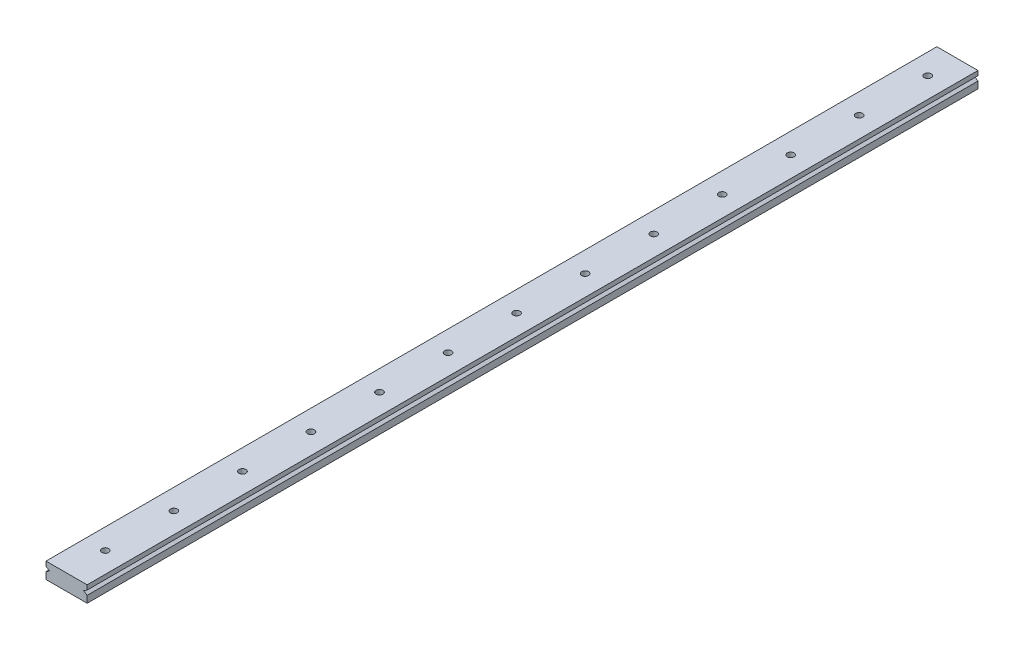
ISO-10303-21;
HEADER;
FILE_DESCRIPTION(('STEP AP214'),'2;1');
FILE_NAME('part.step','',(''),(''),'','','');
FILE_SCHEMA(('AUTOMOTIVE_DESIGN { 1 0 10303 214 1 1 1 1 }'));
ENDSEC;
DATA;
#1=APPLICATION_CONTEXT('core data for automotive mechanical design processes');
#2=APPLICATION_PROTOCOL_DEFINITION('international standard','automotive_design',2000,#1);
#3=PRODUCT_CONTEXT('',#1,'mechanical');
#4=PRODUCT('Part','Part','',(#3));
#5=PRODUCT_RELATED_PRODUCT_CATEGORY('part','',(#4));
#6=PRODUCT_DEFINITION_FORMATION('','',#4);
#7=PRODUCT_DEFINITION_CONTEXT('part definition',#1,'design');
#8=PRODUCT_DEFINITION('design','',#6,#7);
#9=PRODUCT_DEFINITION_SHAPE('','',#8);
#10=(LENGTH_UNIT() NAMED_UNIT(*) SI_UNIT(.MILLI.,.METRE.));
#11=(NAMED_UNIT(*) PLANE_ANGLE_UNIT() SI_UNIT($,.RADIAN.));
#12=(NAMED_UNIT(*) SI_UNIT($,.STERADIAN.) SOLID_ANGLE_UNIT());
#13=UNCERTAINTY_MEASURE_WITH_UNIT(LENGTH_MEASURE(1.E-05),#10,'distance_accuracy_value','');
#14=(GEOMETRIC_REPRESENTATION_CONTEXT(3) GLOBAL_UNCERTAINTY_ASSIGNED_CONTEXT((#13)) GLOBAL_UNIT_ASSIGNED_CONTEXT((#10,
#11,#12)) REPRESENTATION_CONTEXT('',''));
#15=CARTESIAN_POINT('',(0.,0.,0.));
#16=DIRECTION('',(0.,0.,1.));
#17=DIRECTION('',(1.,0.,0.));
#18=AXIS2_PLACEMENT_3D('',#15,#16,#17);
#19=CARTESIAN_POINT('',(9.,-3.5,390.));
#20=DIRECTION('',(-1.,0.,0.));
#21=DIRECTION('',(0.,0.,1.));
#22=AXIS2_PLACEMENT_3D('',#19,#20,#21);
#23=PLANE('',#22);
#24=DIRECTION('',(0.,0.,-1.));
#25=VECTOR('',#24,1.);
#26=CARTESIAN_POINT('',(9.,1.5,390.));
#27=LINE('',#26,#25);
#28=CARTESIAN_POINT('',(9.,1.5,390.));
#29=VERTEX_POINT('',#28);
#30=CARTESIAN_POINT('',(9.,1.5,0.));
#31=VERTEX_POINT('',#30);
#32=EDGE_CURVE('E111',#29,#31,#27,.T.);
#33=ORIENTED_EDGE('',*,*,#32,.T.);
#34=DIRECTION('',(0.,1.,0.));
#35=VECTOR('',#34,1.);
#36=CARTESIAN_POINT('',(9.,-3.5,0.));
#37=LINE('',#36,#35);
#38=CARTESIAN_POINT('',(9.,3.5,0.));
#39=VERTEX_POINT('',#38);
#40=EDGE_CURVE('E155',#31,#39,#37,.T.);
#41=ORIENTED_EDGE('',*,*,#40,.T.);
#42=DIRECTION('',(0.,0.,-1.));
#43=VECTOR('',#42,1.);
#44=CARTESIAN_POINT('',(9.,3.5,390.));
#45=LINE('',#44,#43);
#46=CARTESIAN_POINT('',(9.,3.5,390.));
#47=VERTEX_POINT('',#46);
#48=EDGE_CURVE('E11',#47,#39,#45,.T.);
#49=ORIENTED_EDGE('',*,*,#48,.F.);
#50=DIRECTION('',(0.,1.,0.));
#51=VECTOR('',#50,1.);
#52=CARTESIAN_POINT('',(9.,-3.5,390.));
#53=LINE('',#52,#51);
#54=EDGE_CURVE('E127',#29,#47,#53,.T.);
#55=ORIENTED_EDGE('',*,*,#54,.F.);
#56=EDGE_LOOP('',(#33,#41,#49,#55));
#57=FACE_BOUND('',#56,.T.);
#58=ADVANCED_FACE('F34',(#57),#23,.F.);
#59=DIRECTION('',(0.,0.,-1.));
#60=VECTOR('',#59,1.);
#61=CARTESIAN_POINT('',(9.,-0.499999999999999,390.));
#62=LINE('',#61,#60);
#63=CARTESIAN_POINT('',(9.,-0.499999999999999,390.));
#64=VERTEX_POINT('',#63);
#65=CARTESIAN_POINT('',(9.,-0.499999999999999,0.));
#66=VERTEX_POINT('',#65);
#67=EDGE_CURVE('E58',#64,#66,#62,.T.);
#68=ORIENTED_EDGE('',*,*,#67,.F.);
#69=CARTESIAN_POINT('',(9.,-3.5,390.));
#70=VERTEX_POINT('',#69);
#71=EDGE_CURVE('E133',#70,#64,#53,.T.);
#72=ORIENTED_EDGE('',*,*,#71,.F.);
#73=DIRECTION('',(0.,0.,-1.));
#74=VECTOR('',#73,1.);
#75=CARTESIAN_POINT('',(9.,-3.5,390.));
#76=LINE('',#75,#74);
#77=CARTESIAN_POINT('',(9.,-3.5,0.));
#78=VERTEX_POINT('',#77);
#79=EDGE_CURVE('E150',#70,#78,#76,.T.);
#80=ORIENTED_EDGE('',*,*,#79,.T.);
#81=EDGE_CURVE('E151',#78,#66,#37,.T.);
#82=ORIENTED_EDGE('',*,*,#81,.T.);
#83=EDGE_LOOP('',(#68,#72,#80,#82));
#84=FACE_BOUND('',#83,.T.);
#85=ADVANCED_FACE('F295',(#84),#23,.F.);
#86=CARTESIAN_POINT('',(-9.,-3.5,390.));
#87=DIRECTION('',(1.,0.,0.));
#88=DIRECTION('',(0.,0.,-1.));
#89=AXIS2_PLACEMENT_3D('',#86,#87,#88);
#90=PLANE('',#89);
#91=DIRECTION('',(0.,-1.,0.));
#92=VECTOR('',#91,1.);
#93=CARTESIAN_POINT('',(-9.,-3.5,0.));
#94=LINE('',#93,#92);
#95=CARTESIAN_POINT('',(-9.,3.5,0.));
#96=VERTEX_POINT('',#95);
#97=CARTESIAN_POINT('',(-9.,1.5,0.));
#98=VERTEX_POINT('',#97);
#99=EDGE_CURVE('E137',#96,#98,#94,.T.);
#100=ORIENTED_EDGE('',*,*,#99,.T.);
#101=DIRECTION('',(0.,0.,-1.));
#102=VECTOR('',#101,1.);
#103=CARTESIAN_POINT('',(-9.,1.5,390.));
#104=LINE('',#103,#102);
#105=CARTESIAN_POINT('',(-9.,1.5,390.));
#106=VERTEX_POINT('',#105);
#107=EDGE_CURVE('E221',#106,#98,#104,.T.);
#108=ORIENTED_EDGE('',*,*,#107,.F.);
#109=DIRECTION('',(0.,-1.,0.));
#110=VECTOR('',#109,1.);
#111=CARTESIAN_POINT('',(-9.,-3.5,390.));
#112=LINE('',#111,#110);
#113=CARTESIAN_POINT('',(-9.,3.5,390.));
#114=VERTEX_POINT('',#113);
#115=EDGE_CURVE('E145',#114,#106,#112,.T.);
#116=ORIENTED_EDGE('',*,*,#115,.F.);
#117=DIRECTION('',(0.,0.,-1.));
#118=VECTOR('',#117,1.);
#119=CARTESIAN_POINT('',(-9.,3.5,390.));
#120=LINE('',#119,#118);
#121=EDGE_CURVE('E42',#114,#96,#120,.T.);
#122=ORIENTED_EDGE('',*,*,#121,.T.);
#123=EDGE_LOOP('',(#100,#108,#116,#122));
#124=FACE_BOUND('',#123,.T.);
#125=ADVANCED_FACE('F220',(#124),#90,.F.);
#126=CARTESIAN_POINT('',(0.,0.,390.));
#127=DIRECTION('',(0.,0.,-1.));
#128=DIRECTION('',(-1.,0.,0.));
#129=AXIS2_PLACEMENT_3D('',#126,#127,#128);
#130=PLANE('',#129);
#131=DIRECTION('',(-0.832050294337844,-0.554700196225229,0.));
#132=VECTOR('',#131,1.);
#133=CARTESIAN_POINT('',(2.07692307692308,-3.11538461538461,390.));
#134=LINE('',#133,#132);
#135=CARTESIAN_POINT('',(7.5,0.500000000000001,390.));
#136=VERTEX_POINT('',#135);
#137=EDGE_CURVE('E115',#29,#136,#134,.T.);
#138=ORIENTED_EDGE('',*,*,#137,.F.);
#139=ORIENTED_EDGE('',*,*,#54,.T.);
#140=DIRECTION('',(-1.,0.,0.));
#141=VECTOR('',#140,1.);
#142=CARTESIAN_POINT('',(-9.,3.5,390.));
#143=LINE('',#142,#141);
#144=EDGE_CURVE('E136',#47,#114,#143,.T.);
#145=ORIENTED_EDGE('',*,*,#144,.T.);
#146=ORIENTED_EDGE('',*,*,#115,.T.);
#147=DIRECTION('',(0.832050294337844,-0.554700196225229,0.));
#148=VECTOR('',#147,1.);
#149=CARTESIAN_POINT('',(-2.07692307692308,-3.11538461538461,390.));
#150=LINE('',#149,#148);
#151=CARTESIAN_POINT('',(-7.5,0.500000000000001,390.));
#152=VERTEX_POINT('',#151);
#153=EDGE_CURVE('E217',#106,#152,#150,.T.);
#154=ORIENTED_EDGE('',*,*,#153,.T.);
#155=DIRECTION('',(-0.832050294337844,-0.554700196225229,0.));
#156=VECTOR('',#155,1.);
#157=CARTESIAN_POINT('',(-2.53846153846154,3.80769230769231,390.));
#158=LINE('',#157,#156);
#159=CARTESIAN_POINT('',(-9.,-0.499999999999999,390.));
#160=VERTEX_POINT('',#159);
#161=EDGE_CURVE('E233',#152,#160,#158,.T.);
#162=ORIENTED_EDGE('',*,*,#161,.T.);
#163=CARTESIAN_POINT('',(-9.,-3.5,390.));
#164=VERTEX_POINT('',#163);
#165=EDGE_CURVE('E144',#160,#164,#112,.T.);
#166=ORIENTED_EDGE('',*,*,#165,.T.);
#167=DIRECTION('',(1.,0.,0.));
#168=VECTOR('',#167,1.);
#169=CARTESIAN_POINT('',(-9.,-3.5,390.));
#170=LINE('',#169,#168);
#171=EDGE_CURVE('E148',#164,#70,#170,.T.);
#172=ORIENTED_EDGE('',*,*,#171,.T.);
#173=ORIENTED_EDGE('',*,*,#71,.T.);
#174=DIRECTION('',(0.832050294337844,-0.554700196225229,0.));
#175=VECTOR('',#174,1.);
#176=CARTESIAN_POINT('',(2.53846153846154,3.80769230769231,390.));
#177=LINE('',#176,#175);
#178=EDGE_CURVE('E122',#136,#64,#177,.T.);
#179=ORIENTED_EDGE('',*,*,#178,.F.);
#180=EDGE_LOOP('',(#138,#139,#145,#146,#154,#162,#166,#172,#173,#179));
#181=FACE_BOUND('',#180,.T.);
#182=ADVANCED_FACE('F126',(#181),#130,.F.);
#183=CARTESIAN_POINT('',(0.,0.,0.));
#184=DIRECTION('',(0.,0.,-1.));
#185=DIRECTION('',(-1.,0.,0.));
#186=AXIS2_PLACEMENT_3D('',#183,#184,#185);
#187=PLANE('',#186);
#188=ORIENTED_EDGE('',*,*,#40,.F.);
#189=DIRECTION('',(-0.832050294337844,-0.554700196225229,0.));
#190=VECTOR('',#189,1.);
#191=CARTESIAN_POINT('',(2.07692307692308,-3.11538461538461,0.));
#192=LINE('',#191,#190);
#193=CARTESIAN_POINT('',(7.5,0.500000000000001,0.));
#194=VERTEX_POINT('',#193);
#195=EDGE_CURVE('E118',#31,#194,#192,.T.);
#196=ORIENTED_EDGE('',*,*,#195,.T.);
#197=DIRECTION('',(0.832050294337844,-0.554700196225229,0.));
#198=VECTOR('',#197,1.);
#199=CARTESIAN_POINT('',(2.53846153846154,3.80769230769231,0.));
#200=LINE('',#199,#198);
#201=EDGE_CURVE('E130',#194,#66,#200,.T.);
#202=ORIENTED_EDGE('',*,*,#201,.T.);
#203=ORIENTED_EDGE('',*,*,#81,.F.);
#204=DIRECTION('',(1.,0.,0.));
#205=VECTOR('',#204,1.);
#206=CARTESIAN_POINT('',(-9.,-3.5,0.));
#207=LINE('',#206,#205);
#208=CARTESIAN_POINT('',(-9.,-3.5,0.));
#209=VERTEX_POINT('',#208);
#210=EDGE_CURVE('E134',#209,#78,#207,.T.);
#211=ORIENTED_EDGE('',*,*,#210,.F.);
#212=CARTESIAN_POINT('',(-9.,-0.499999999999999,0.));
#213=VERTEX_POINT('',#212);
#214=EDGE_CURVE('E157',#213,#209,#94,.T.);
#215=ORIENTED_EDGE('',*,*,#214,.F.);
#216=DIRECTION('',(-0.832050294337844,-0.554700196225229,0.));
#217=VECTOR('',#216,1.);
#218=CARTESIAN_POINT('',(-2.53846153846154,3.80769230769231,0.));
#219=LINE('',#218,#217);
#220=CARTESIAN_POINT('',(-7.5,0.500000000000002,0.));
#221=VERTEX_POINT('',#220);
#222=EDGE_CURVE('E229',#221,#213,#219,.T.);
#223=ORIENTED_EDGE('',*,*,#222,.F.);
#224=DIRECTION('',(0.832050294337844,-0.554700196225229,0.));
#225=VECTOR('',#224,1.);
#226=CARTESIAN_POINT('',(-2.07692307692308,-3.11538461538461,0.));
#227=LINE('',#226,#225);
#228=EDGE_CURVE('E50',#98,#221,#227,.T.);
#229=ORIENTED_EDGE('',*,*,#228,.F.);
#230=ORIENTED_EDGE('',*,*,#99,.F.);
#231=DIRECTION('',(-1.,0.,0.));
#232=VECTOR('',#231,1.);
#233=CARTESIAN_POINT('',(-9.,3.5,0.));
#234=LINE('',#233,#232);
#235=EDGE_CURVE('E154',#39,#96,#234,.T.);
#236=ORIENTED_EDGE('',*,*,#235,.F.);
#237=EDGE_LOOP('',(#188,#196,#202,#203,#211,#215,#223,#229,#230,#236));
#238=FACE_BOUND('',#237,.T.);
#239=ADVANCED_FACE('F210',(#238),#187,.T.);
#240=CARTESIAN_POINT('',(-9.,3.5,390.));
#241=DIRECTION('',(0.,-1.,0.));
#242=DIRECTION('',(0.,0.,-1.));
#243=AXIS2_PLACEMENT_3D('',#240,#241,#242);
#244=PLANE('',#243);
#245=CARTESIAN_POINT('',(0.,3.5,13.));
#246=DIRECTION('',(0.,1.,0.));
#247=DIRECTION('',(0.,0.,1.));
#248=AXIS2_PLACEMENT_3D('',#245,#246,#247);
#249=CIRCLE('',#248,1.5);
#250=CARTESIAN_POINT('',(0.,3.5,14.5));
#251=VERTEX_POINT('',#250);
#252=EDGE_CURVE('E171',#251,#251,#249,.T.);
#253=ORIENTED_EDGE('',*,*,#252,.F.);
#254=EDGE_LOOP('',(#253));
#255=FACE_BOUND('',#254,.T.);
#256=CARTESIAN_POINT('',(0.,3.5,43.));
#257=DIRECTION('',(0.,1.,0.));
#258=DIRECTION('',(0.,0.,1.));
#259=AXIS2_PLACEMENT_3D('',#256,#257,#258);
#260=CIRCLE('',#259,1.5);
#261=CARTESIAN_POINT('',(0.,3.5,44.5));
#262=VERTEX_POINT('',#261);
#263=EDGE_CURVE('E236',#262,#262,#260,.T.);
#264=ORIENTED_EDGE('',*,*,#263,.F.);
#265=EDGE_LOOP('',(#264));
#266=FACE_BOUND('',#265,.T.);
#267=CARTESIAN_POINT('',(0.,3.5,73.));
#268=DIRECTION('',(0.,1.,0.));
#269=DIRECTION('',(0.,0.,1.));
#270=AXIS2_PLACEMENT_3D('',#267,#268,#269);
#271=CIRCLE('',#270,1.5);
#272=CARTESIAN_POINT('',(0.,3.5,74.5));
#273=VERTEX_POINT('',#272);
#274=EDGE_CURVE('E239',#273,#273,#271,.T.);
#275=ORIENTED_EDGE('',*,*,#274,.F.);
#276=EDGE_LOOP('',(#275));
#277=FACE_BOUND('',#276,.T.);
#278=CARTESIAN_POINT('',(0.,3.5,133.));
#279=DIRECTION('',(0.,1.,0.));
#280=DIRECTION('',(0.,0.,1.));
#281=AXIS2_PLACEMENT_3D('',#278,#279,#280);
#282=CIRCLE('',#281,1.5);
#283=CARTESIAN_POINT('',(0.,3.5,134.5));
#284=VERTEX_POINT('',#283);
#285=EDGE_CURVE('E242',#284,#284,#282,.T.);
#286=ORIENTED_EDGE('',*,*,#285,.F.);
#287=EDGE_LOOP('',(#286));
#288=FACE_BOUND('',#287,.T.);
#289=CARTESIAN_POINT('',(0.,3.5,103.));
#290=DIRECTION('',(0.,1.,0.));
#291=DIRECTION('',(0.,0.,1.));
#292=AXIS2_PLACEMENT_3D('',#289,#290,#291);
#293=CIRCLE('',#292,1.5);
#294=CARTESIAN_POINT('',(0.,3.5,104.5));
#295=VERTEX_POINT('',#294);
#296=EDGE_CURVE('E245',#295,#295,#293,.T.);
#297=ORIENTED_EDGE('',*,*,#296,.F.);
#298=EDGE_LOOP('',(#297));
#299=FACE_BOUND('',#298,.T.);
#300=CARTESIAN_POINT('',(0.,3.5,163.));
#301=DIRECTION('',(0.,1.,0.));
#302=DIRECTION('',(0.,0.,1.));
#303=AXIS2_PLACEMENT_3D('',#300,#301,#302);
#304=CIRCLE('',#303,1.5);
#305=CARTESIAN_POINT('',(0.,3.5,164.5));
#306=VERTEX_POINT('',#305);
#307=EDGE_CURVE('E248',#306,#306,#304,.T.);
#308=ORIENTED_EDGE('',*,*,#307,.F.);
#309=EDGE_LOOP('',(#308));
#310=FACE_BOUND('',#309,.T.);
#311=CARTESIAN_POINT('',(0.,3.5,193.));
#312=DIRECTION('',(0.,1.,0.));
#313=DIRECTION('',(0.,0.,1.));
#314=AXIS2_PLACEMENT_3D('',#311,#312,#313);
#315=CIRCLE('',#314,1.5);
#316=CARTESIAN_POINT('',(0.,3.5,194.5));
#317=VERTEX_POINT('',#316);
#318=EDGE_CURVE('E251',#317,#317,#315,.T.);
#319=ORIENTED_EDGE('',*,*,#318,.F.);
#320=EDGE_LOOP('',(#319));
#321=FACE_BOUND('',#320,.T.);
#322=CARTESIAN_POINT('',(0.,3.5,223.));
#323=DIRECTION('',(0.,1.,0.));
#324=DIRECTION('',(0.,0.,1.));
#325=AXIS2_PLACEMENT_3D('',#322,#323,#324);
#326=CIRCLE('',#325,1.5);
#327=CARTESIAN_POINT('',(0.,3.5,224.5));
#328=VERTEX_POINT('',#327);
#329=EDGE_CURVE('E254',#328,#328,#326,.T.);
#330=ORIENTED_EDGE('',*,*,#329,.F.);
#331=EDGE_LOOP('',(#330));
#332=FACE_BOUND('',#331,.T.);
#333=CARTESIAN_POINT('',(0.,3.5,253.));
#334=DIRECTION('',(0.,1.,0.));
#335=DIRECTION('',(0.,0.,1.));
#336=AXIS2_PLACEMENT_3D('',#333,#334,#335);
#337=CIRCLE('',#336,1.5);
#338=CARTESIAN_POINT('',(0.,3.5,254.5));
#339=VERTEX_POINT('',#338);
#340=EDGE_CURVE('E257',#339,#339,#337,.T.);
#341=ORIENTED_EDGE('',*,*,#340,.F.);
#342=EDGE_LOOP('',(#341));
#343=FACE_BOUND('',#342,.T.);
#344=CARTESIAN_POINT('',(0.,3.5,283.));
#345=DIRECTION('',(0.,1.,0.));
#346=DIRECTION('',(0.,0.,1.));
#347=AXIS2_PLACEMENT_3D('',#344,#345,#346);
#348=CIRCLE('',#347,1.5);
#349=CARTESIAN_POINT('',(0.,3.5,284.5));
#350=VERTEX_POINT('',#349);
#351=EDGE_CURVE('E260',#350,#350,#348,.T.);
#352=ORIENTED_EDGE('',*,*,#351,.F.);
#353=EDGE_LOOP('',(#352));
#354=FACE_BOUND('',#353,.T.);
#355=CARTESIAN_POINT('',(0.,3.5,313.));
#356=DIRECTION('',(0.,1.,0.));
#357=DIRECTION('',(0.,0.,1.));
#358=AXIS2_PLACEMENT_3D('',#355,#356,#357);
#359=CIRCLE('',#358,1.5);
#360=CARTESIAN_POINT('',(0.,3.5,314.5));
#361=VERTEX_POINT('',#360);
#362=EDGE_CURVE('E263',#361,#361,#359,.T.);
#363=ORIENTED_EDGE('',*,*,#362,.F.);
#364=EDGE_LOOP('',(#363));
#365=FACE_BOUND('',#364,.T.);
#366=CARTESIAN_POINT('',(0.,3.5,343.));
#367=DIRECTION('',(0.,1.,0.));
#368=DIRECTION('',(0.,0.,1.));
#369=AXIS2_PLACEMENT_3D('',#366,#367,#368);
#370=CIRCLE('',#369,1.5);
#371=CARTESIAN_POINT('',(0.,3.5,344.5));
#372=VERTEX_POINT('',#371);
#373=EDGE_CURVE('E265',#372,#372,#370,.T.);
#374=ORIENTED_EDGE('',*,*,#373,.F.);
#375=EDGE_LOOP('',(#374));
#376=FACE_BOUND('',#375,.T.);
#377=CARTESIAN_POINT('',(0.,3.5,373.));
#378=DIRECTION('',(0.,1.,0.));
#379=DIRECTION('',(0.,0.,1.));
#380=AXIS2_PLACEMENT_3D('',#377,#378,#379);
#381=CIRCLE('',#380,1.5);
#382=CARTESIAN_POINT('',(0.,3.5,374.5));
#383=VERTEX_POINT('',#382);
#384=EDGE_CURVE('E141',#383,#383,#381,.T.);
#385=ORIENTED_EDGE('',*,*,#384,.F.);
#386=EDGE_LOOP('',(#385));
#387=FACE_BOUND('',#386,.T.);
#388=ORIENTED_EDGE('',*,*,#235,.T.);
#389=ORIENTED_EDGE('',*,*,#121,.F.);
#390=ORIENTED_EDGE('',*,*,#144,.F.);
#391=ORIENTED_EDGE('',*,*,#48,.T.);
#392=EDGE_LOOP('',(#388,#389,#390,#391));
#393=FACE_BOUND('',#392,.T.);
#394=ADVANCED_FACE('F213',(#255,#266,#277,#288,#299,#310,#321,#332,#343,#354,#365,#376,#387,
#393),#244,.F.);
#395=ORIENTED_EDGE('',*,*,#165,.F.);
#396=DIRECTION('',(0.,0.,-1.));
#397=VECTOR('',#396,1.);
#398=CARTESIAN_POINT('',(-9.,-0.499999999999999,390.));
#399=LINE('',#398,#397);
#400=EDGE_CURVE('E222',#160,#213,#399,.T.);
#401=ORIENTED_EDGE('',*,*,#400,.T.);
#402=ORIENTED_EDGE('',*,*,#214,.T.);
#403=DIRECTION('',(0.,0.,-1.));
#404=VECTOR('',#403,1.);
#405=CARTESIAN_POINT('',(-9.,-3.5,390.));
#406=LINE('',#405,#404);
#407=EDGE_CURVE('E162',#164,#209,#406,.T.);
#408=ORIENTED_EDGE('',*,*,#407,.F.);
#409=EDGE_LOOP('',(#395,#401,#402,#408));
#410=FACE_BOUND('',#409,.T.);
#411=ADVANCED_FACE('F285',(#410),#90,.F.);
#412=CARTESIAN_POINT('',(-9.,-3.5,390.));
#413=DIRECTION('',(0.,1.,0.));
#414=DIRECTION('',(0.,0.,1.));
#415=AXIS2_PLACEMENT_3D('',#412,#413,#414);
#416=PLANE('',#415);
#417=CARTESIAN_POINT('',(0.,-3.5,13.));
#418=DIRECTION('',(0.,1.,0.));
#419=DIRECTION('',(0.,0.,1.));
#420=AXIS2_PLACEMENT_3D('',#417,#418,#419);
#421=CIRCLE('',#420,1.5);
#422=CARTESIAN_POINT('',(0.,-3.5,14.5));
#423=VERTEX_POINT('',#422);
#424=EDGE_CURVE('E37',#423,#423,#421,.T.);
#425=ORIENTED_EDGE('',*,*,#424,.T.);
#426=EDGE_LOOP('',(#425));
#427=FACE_BOUND('',#426,.T.);
#428=CARTESIAN_POINT('',(0.,-3.5,43.));
#429=DIRECTION('',(0.,1.,0.));
#430=DIRECTION('',(0.,0.,1.));
#431=AXIS2_PLACEMENT_3D('',#428,#429,#430);
#432=CIRCLE('',#431,1.5);
#433=CARTESIAN_POINT('',(0.,-3.5,44.5));
#434=VERTEX_POINT('',#433);
#435=EDGE_CURVE('E200',#434,#434,#432,.T.);
#436=ORIENTED_EDGE('',*,*,#435,.T.);
#437=EDGE_LOOP('',(#436));
#438=FACE_BOUND('',#437,.T.);
#439=CARTESIAN_POINT('',(0.,-3.5,73.));
#440=DIRECTION('',(0.,1.,0.));
#441=DIRECTION('',(0.,0.,1.));
#442=AXIS2_PLACEMENT_3D('',#439,#440,#441);
#443=CIRCLE('',#442,1.5);
#444=CARTESIAN_POINT('',(0.,-3.5,74.5));
#445=VERTEX_POINT('',#444);
#446=EDGE_CURVE('E198',#445,#445,#443,.T.);
#447=ORIENTED_EDGE('',*,*,#446,.T.);
#448=EDGE_LOOP('',(#447));
#449=FACE_BOUND('',#448,.T.);
#450=CARTESIAN_POINT('',(0.,-3.5,133.));
#451=DIRECTION('',(0.,1.,0.));
#452=DIRECTION('',(0.,0.,1.));
#453=AXIS2_PLACEMENT_3D('',#450,#451,#452);
#454=CIRCLE('',#453,1.5);
#455=CARTESIAN_POINT('',(0.,-3.5,134.5));
#456=VERTEX_POINT('',#455);
#457=EDGE_CURVE('E195',#456,#456,#454,.T.);
#458=ORIENTED_EDGE('',*,*,#457,.T.);
#459=EDGE_LOOP('',(#458));
#460=FACE_BOUND('',#459,.T.);
#461=CARTESIAN_POINT('',(0.,-3.5,103.));
#462=DIRECTION('',(0.,1.,0.));
#463=DIRECTION('',(0.,0.,1.));
#464=AXIS2_PLACEMENT_3D('',#461,#462,#463);
#465=CIRCLE('',#464,1.5);
#466=CARTESIAN_POINT('',(0.,-3.5,104.5));
#467=VERTEX_POINT('',#466);
#468=EDGE_CURVE('E192',#467,#467,#465,.T.);
#469=ORIENTED_EDGE('',*,*,#468,.T.);
#470=EDGE_LOOP('',(#469));
#471=FACE_BOUND('',#470,.T.);
#472=CARTESIAN_POINT('',(0.,-3.5,163.));
#473=DIRECTION('',(0.,1.,0.));
#474=DIRECTION('',(0.,0.,1.));
#475=AXIS2_PLACEMENT_3D('',#472,#473,#474);
#476=CIRCLE('',#475,1.5);
#477=CARTESIAN_POINT('',(0.,-3.5,164.5));
#478=VERTEX_POINT('',#477);
#479=EDGE_CURVE('E189',#478,#478,#476,.T.);
#480=ORIENTED_EDGE('',*,*,#479,.T.);
#481=EDGE_LOOP('',(#480));
#482=FACE_BOUND('',#481,.T.);
#483=CARTESIAN_POINT('',(0.,-3.5,193.));
#484=DIRECTION('',(0.,1.,0.));
#485=DIRECTION('',(0.,0.,1.));
#486=AXIS2_PLACEMENT_3D('',#483,#484,#485);
#487=CIRCLE('',#486,1.5);
#488=CARTESIAN_POINT('',(0.,-3.5,194.5));
#489=VERTEX_POINT('',#488);
#490=EDGE_CURVE('E186',#489,#489,#487,.T.);
#491=ORIENTED_EDGE('',*,*,#490,.T.);
#492=EDGE_LOOP('',(#491));
#493=FACE_BOUND('',#492,.T.);
#494=CARTESIAN_POINT('',(0.,-3.5,223.));
#495=DIRECTION('',(0.,1.,0.));
#496=DIRECTION('',(0.,0.,1.));
#497=AXIS2_PLACEMENT_3D('',#494,#495,#496);
#498=CIRCLE('',#497,1.5);
#499=CARTESIAN_POINT('',(0.,-3.5,224.5));
#500=VERTEX_POINT('',#499);
#501=EDGE_CURVE('E183',#500,#500,#498,.T.);
#502=ORIENTED_EDGE('',*,*,#501,.T.);
#503=EDGE_LOOP('',(#502));
#504=FACE_BOUND('',#503,.T.);
#505=CARTESIAN_POINT('',(0.,-3.5,253.));
#506=DIRECTION('',(0.,1.,0.));
#507=DIRECTION('',(0.,0.,1.));
#508=AXIS2_PLACEMENT_3D('',#505,#506,#507);
#509=CIRCLE('',#508,1.5);
#510=CARTESIAN_POINT('',(0.,-3.5,254.5));
#511=VERTEX_POINT('',#510);
#512=EDGE_CURVE('E180',#511,#511,#509,.T.);
#513=ORIENTED_EDGE('',*,*,#512,.T.);
#514=EDGE_LOOP('',(#513));
#515=FACE_BOUND('',#514,.T.);
#516=CARTESIAN_POINT('',(0.,-3.5,283.));
#517=DIRECTION('',(0.,1.,0.));
#518=DIRECTION('',(0.,0.,1.));
#519=AXIS2_PLACEMENT_3D('',#516,#517,#518);
#520=CIRCLE('',#519,1.5);
#521=CARTESIAN_POINT('',(0.,-3.5,284.5));
#522=VERTEX_POINT('',#521);
#523=EDGE_CURVE('E177',#522,#522,#520,.T.);
#524=ORIENTED_EDGE('',*,*,#523,.T.);
#525=EDGE_LOOP('',(#524));
#526=FACE_BOUND('',#525,.T.);
#527=CARTESIAN_POINT('',(0.,-3.5,313.));
#528=DIRECTION('',(0.,1.,0.));
#529=DIRECTION('',(0.,0.,1.));
#530=AXIS2_PLACEMENT_3D('',#527,#528,#529);
#531=CIRCLE('',#530,1.5);
#532=CARTESIAN_POINT('',(0.,-3.5,314.5));
#533=VERTEX_POINT('',#532);
#534=EDGE_CURVE('E174',#533,#533,#531,.T.);
#535=ORIENTED_EDGE('',*,*,#534,.T.);
#536=EDGE_LOOP('',(#535));
#537=FACE_BOUND('',#536,.T.);
#538=CARTESIAN_POINT('',(0.,-3.5,343.));
#539=DIRECTION('',(0.,1.,0.));
#540=DIRECTION('',(0.,0.,1.));
#541=AXIS2_PLACEMENT_3D('',#538,#539,#540);
#542=CIRCLE('',#541,1.5);
#543=CARTESIAN_POINT('',(0.,-3.5,344.5));
#544=VERTEX_POINT('',#543);
#545=EDGE_CURVE('E170',#544,#544,#542,.T.);
#546=ORIENTED_EDGE('',*,*,#545,.T.);
#547=EDGE_LOOP('',(#546));
#548=FACE_BOUND('',#547,.T.);
#549=CARTESIAN_POINT('',(0.,-3.5,373.));
#550=DIRECTION('',(0.,1.,0.));
#551=DIRECTION('',(0.,0.,1.));
#552=AXIS2_PLACEMENT_3D('',#549,#550,#551);
#553=CIRCLE('',#552,1.5);
#554=CARTESIAN_POINT('',(0.,-3.5,374.5));
#555=VERTEX_POINT('',#554);
#556=EDGE_CURVE('E167',#555,#555,#553,.T.);
#557=ORIENTED_EDGE('',*,*,#556,.T.);
#558=EDGE_LOOP('',(#557));
#559=FACE_BOUND('',#558,.T.);
#560=ORIENTED_EDGE('',*,*,#210,.T.);
#561=ORIENTED_EDGE('',*,*,#79,.F.);
#562=ORIENTED_EDGE('',*,*,#171,.F.);
#563=ORIENTED_EDGE('',*,*,#407,.T.);
#564=EDGE_LOOP('',(#560,#561,#562,#563));
#565=FACE_BOUND('',#564,.T.);
#566=ADVANCED_FACE('F291',(#427,#438,#449,#460,#471,#482,#493,#504,#515,#526,#537,#548,#559,
#565),#416,.F.);
#567=CARTESIAN_POINT('',(0.,-386.5,373.));
#568=DIRECTION('',(0.,1.,0.));
#569=DIRECTION('',(0.,0.,1.));
#570=AXIS2_PLACEMENT_3D('',#567,#568,#569);
#571=CYLINDRICAL_SURFACE('',#570,1.5);
#572=ORIENTED_EDGE('',*,*,#384,.T.);
#573=EDGE_LOOP('',(#572));
#574=FACE_BOUND('',#573,.T.);
#575=ORIENTED_EDGE('',*,*,#556,.F.);
#576=EDGE_LOOP('',(#575));
#577=FACE_BOUND('',#576,.T.);
#578=ADVANCED_FACE('F431',(#574,#577),#571,.F.);
#579=CARTESIAN_POINT('',(0.,-386.5,343.));
#580=DIRECTION('',(0.,1.,0.));
#581=DIRECTION('',(0.,0.,1.));
#582=AXIS2_PLACEMENT_3D('',#579,#580,#581);
#583=CYLINDRICAL_SURFACE('',#582,1.5);
#584=ORIENTED_EDGE('',*,*,#373,.T.);
#585=EDGE_LOOP('',(#584));
#586=FACE_BOUND('',#585,.T.);
#587=ORIENTED_EDGE('',*,*,#545,.F.);
#588=EDGE_LOOP('',(#587));
#589=FACE_BOUND('',#588,.T.);
#590=ADVANCED_FACE('F427',(#586,#589),#583,.F.);
#591=CARTESIAN_POINT('',(0.,-386.5,313.));
#592=DIRECTION('',(0.,1.,0.));
#593=DIRECTION('',(0.,0.,1.));
#594=AXIS2_PLACEMENT_3D('',#591,#592,#593);
#595=CYLINDRICAL_SURFACE('',#594,1.5);
#596=ORIENTED_EDGE('',*,*,#362,.T.);
#597=EDGE_LOOP('',(#596));
#598=FACE_BOUND('',#597,.T.);
#599=ORIENTED_EDGE('',*,*,#534,.F.);
#600=EDGE_LOOP('',(#599));
#601=FACE_BOUND('',#600,.T.);
#602=ADVANCED_FACE('F423',(#598,#601),#595,.F.);
#603=CARTESIAN_POINT('',(0.,-386.5,283.));
#604=DIRECTION('',(0.,1.,0.));
#605=DIRECTION('',(0.,0.,1.));
#606=AXIS2_PLACEMENT_3D('',#603,#604,#605);
#607=CYLINDRICAL_SURFACE('',#606,1.5);
#608=ORIENTED_EDGE('',*,*,#351,.T.);
#609=EDGE_LOOP('',(#608));
#610=FACE_BOUND('',#609,.T.);
#611=ORIENTED_EDGE('',*,*,#523,.F.);
#612=EDGE_LOOP('',(#611));
#613=FACE_BOUND('',#612,.T.);
#614=ADVANCED_FACE('F419',(#610,#613),#607,.F.);
#615=CARTESIAN_POINT('',(0.,-386.5,253.));
#616=DIRECTION('',(0.,1.,0.));
#617=DIRECTION('',(0.,0.,1.));
#618=AXIS2_PLACEMENT_3D('',#615,#616,#617);
#619=CYLINDRICAL_SURFACE('',#618,1.5);
#620=ORIENTED_EDGE('',*,*,#340,.T.);
#621=EDGE_LOOP('',(#620));
#622=FACE_BOUND('',#621,.T.);
#623=ORIENTED_EDGE('',*,*,#512,.F.);
#624=EDGE_LOOP('',(#623));
#625=FACE_BOUND('',#624,.T.);
#626=ADVANCED_FACE('F415',(#622,#625),#619,.F.);
#627=CARTESIAN_POINT('',(0.,-386.5,223.));
#628=DIRECTION('',(0.,1.,0.));
#629=DIRECTION('',(0.,0.,1.));
#630=AXIS2_PLACEMENT_3D('',#627,#628,#629);
#631=CYLINDRICAL_SURFACE('',#630,1.5);
#632=ORIENTED_EDGE('',*,*,#329,.T.);
#633=EDGE_LOOP('',(#632));
#634=FACE_BOUND('',#633,.T.);
#635=ORIENTED_EDGE('',*,*,#501,.F.);
#636=EDGE_LOOP('',(#635));
#637=FACE_BOUND('',#636,.T.);
#638=ADVANCED_FACE('F411',(#634,#637),#631,.F.);
#639=CARTESIAN_POINT('',(0.,-386.5,193.));
#640=DIRECTION('',(0.,1.,0.));
#641=DIRECTION('',(0.,0.,1.));
#642=AXIS2_PLACEMENT_3D('',#639,#640,#641);
#643=CYLINDRICAL_SURFACE('',#642,1.5);
#644=ORIENTED_EDGE('',*,*,#318,.T.);
#645=EDGE_LOOP('',(#644));
#646=FACE_BOUND('',#645,.T.);
#647=ORIENTED_EDGE('',*,*,#490,.F.);
#648=EDGE_LOOP('',(#647));
#649=FACE_BOUND('',#648,.T.);
#650=ADVANCED_FACE('F407',(#646,#649),#643,.F.);
#651=CARTESIAN_POINT('',(0.,-386.5,163.));
#652=DIRECTION('',(0.,1.,0.));
#653=DIRECTION('',(0.,0.,1.));
#654=AXIS2_PLACEMENT_3D('',#651,#652,#653);
#655=CYLINDRICAL_SURFACE('',#654,1.5);
#656=ORIENTED_EDGE('',*,*,#307,.T.);
#657=EDGE_LOOP('',(#656));
#658=FACE_BOUND('',#657,.T.);
#659=ORIENTED_EDGE('',*,*,#479,.F.);
#660=EDGE_LOOP('',(#659));
#661=FACE_BOUND('',#660,.T.);
#662=ADVANCED_FACE('F403',(#658,#661),#655,.F.);
#663=CARTESIAN_POINT('',(0.,-386.5,103.));
#664=DIRECTION('',(0.,1.,0.));
#665=DIRECTION('',(0.,0.,1.));
#666=AXIS2_PLACEMENT_3D('',#663,#664,#665);
#667=CYLINDRICAL_SURFACE('',#666,1.5);
#668=ORIENTED_EDGE('',*,*,#296,.T.);
#669=EDGE_LOOP('',(#668));
#670=FACE_BOUND('',#669,.T.);
#671=ORIENTED_EDGE('',*,*,#468,.F.);
#672=EDGE_LOOP('',(#671));
#673=FACE_BOUND('',#672,.T.);
#674=ADVANCED_FACE('F399',(#670,#673),#667,.F.);
#675=CARTESIAN_POINT('',(0.,-386.5,133.));
#676=DIRECTION('',(0.,1.,0.));
#677=DIRECTION('',(0.,0.,1.));
#678=AXIS2_PLACEMENT_3D('',#675,#676,#677);
#679=CYLINDRICAL_SURFACE('',#678,1.5);
#680=ORIENTED_EDGE('',*,*,#285,.T.);
#681=EDGE_LOOP('',(#680));
#682=FACE_BOUND('',#681,.T.);
#683=ORIENTED_EDGE('',*,*,#457,.F.);
#684=EDGE_LOOP('',(#683));
#685=FACE_BOUND('',#684,.T.);
#686=ADVANCED_FACE('F395',(#682,#685),#679,.F.);
#687=CARTESIAN_POINT('',(0.,-386.5,73.));
#688=DIRECTION('',(0.,1.,0.));
#689=DIRECTION('',(0.,0.,1.));
#690=AXIS2_PLACEMENT_3D('',#687,#688,#689);
#691=CYLINDRICAL_SURFACE('',#690,1.5);
#692=ORIENTED_EDGE('',*,*,#274,.T.);
#693=EDGE_LOOP('',(#692));
#694=FACE_BOUND('',#693,.T.);
#695=ORIENTED_EDGE('',*,*,#446,.F.);
#696=EDGE_LOOP('',(#695));
#697=FACE_BOUND('',#696,.T.);
#698=ADVANCED_FACE('F391',(#694,#697),#691,.F.);
#699=CARTESIAN_POINT('',(0.,-386.5,43.));
#700=DIRECTION('',(0.,1.,0.));
#701=DIRECTION('',(0.,0.,1.));
#702=AXIS2_PLACEMENT_3D('',#699,#700,#701);
#703=CYLINDRICAL_SURFACE('',#702,1.5);
#704=ORIENTED_EDGE('',*,*,#263,.T.);
#705=EDGE_LOOP('',(#704));
#706=FACE_BOUND('',#705,.T.);
#707=ORIENTED_EDGE('',*,*,#435,.F.);
#708=EDGE_LOOP('',(#707));
#709=FACE_BOUND('',#708,.T.);
#710=ADVANCED_FACE('F387',(#706,#709),#703,.F.);
#711=CARTESIAN_POINT('',(0.,-386.5,13.));
#712=DIRECTION('',(0.,1.,0.));
#713=DIRECTION('',(0.,0.,1.));
#714=AXIS2_PLACEMENT_3D('',#711,#712,#713);
#715=CYLINDRICAL_SURFACE('',#714,1.5);
#716=ORIENTED_EDGE('',*,*,#252,.T.);
#717=EDGE_LOOP('',(#716));
#718=FACE_BOUND('',#717,.T.);
#719=ORIENTED_EDGE('',*,*,#424,.F.);
#720=EDGE_LOOP('',(#719));
#721=FACE_BOUND('',#720,.T.);
#722=ADVANCED_FACE('F311',(#718,#721),#715,.F.);
#723=CARTESIAN_POINT('',(-2.07692307692308,-3.11538461538461,390.));
#724=DIRECTION('',(0.554700196225229,0.832050294337843,0.));
#725=DIRECTION('',(-0.832050294337844,0.554700196225229,0.));
#726=AXIS2_PLACEMENT_3D('',#723,#724,#725);
#727=PLANE('',#726);
#728=ORIENTED_EDGE('',*,*,#228,.T.);
#729=DIRECTION('',(0.,0.,-1.));
#730=VECTOR('',#729,1.);
#731=CARTESIAN_POINT('',(-7.5,0.500000000000001,390.));
#732=LINE('',#731,#730);
#733=EDGE_CURVE('E226',#152,#221,#732,.T.);
#734=ORIENTED_EDGE('',*,*,#733,.F.);
#735=ORIENTED_EDGE('',*,*,#153,.F.);
#736=ORIENTED_EDGE('',*,*,#107,.T.);
#737=EDGE_LOOP('',(#728,#734,#735,#736));
#738=FACE_BOUND('',#737,.T.);
#739=ADVANCED_FACE('F353',(#738),#727,.F.);
#740=CARTESIAN_POINT('',(-2.53846153846154,3.80769230769231,390.));
#741=DIRECTION('',(0.554700196225229,-0.832050294337843,0.));
#742=DIRECTION('',(0.832050294337844,0.554700196225229,0.));
#743=AXIS2_PLACEMENT_3D('',#740,#741,#742);
#744=PLANE('',#743);
#745=ORIENTED_EDGE('',*,*,#222,.T.);
#746=ORIENTED_EDGE('',*,*,#400,.F.);
#747=ORIENTED_EDGE('',*,*,#161,.F.);
#748=ORIENTED_EDGE('',*,*,#733,.T.);
#749=EDGE_LOOP('',(#745,#746,#747,#748));
#750=FACE_BOUND('',#749,.T.);
#751=ADVANCED_FACE('F280',(#750),#744,.F.);
#752=CARTESIAN_POINT('',(2.07692307692308,-3.11538461538461,390.));
#753=DIRECTION('',(0.554700196225229,-0.832050294337843,0.));
#754=DIRECTION('',(0.832050294337844,0.554700196225229,0.));
#755=AXIS2_PLACEMENT_3D('',#752,#753,#754);
#756=PLANE('',#755);
#757=ORIENTED_EDGE('',*,*,#195,.F.);
#758=ORIENTED_EDGE('',*,*,#32,.F.);
#759=ORIENTED_EDGE('',*,*,#137,.T.);
#760=DIRECTION('',(0.,0.,-1.));
#761=VECTOR('',#760,1.);
#762=CARTESIAN_POINT('',(7.5,0.500000000000001,390.));
#763=LINE('',#762,#761);
#764=EDGE_CURVE('E270',#136,#194,#763,.T.);
#765=ORIENTED_EDGE('',*,*,#764,.T.);
#766=EDGE_LOOP('',(#757,#758,#759,#765));
#767=FACE_BOUND('',#766,.T.);
#768=ADVANCED_FACE('F113',(#767),#756,.T.);
#769=CARTESIAN_POINT('',(2.53846153846154,3.80769230769231,390.));
#770=DIRECTION('',(0.554700196225229,0.832050294337843,0.));
#771=DIRECTION('',(-0.832050294337844,0.554700196225229,0.));
#772=AXIS2_PLACEMENT_3D('',#769,#770,#771);
#773=PLANE('',#772);
#774=ORIENTED_EDGE('',*,*,#201,.F.);
#775=ORIENTED_EDGE('',*,*,#764,.F.);
#776=ORIENTED_EDGE('',*,*,#178,.T.);
#777=ORIENTED_EDGE('',*,*,#67,.T.);
#778=EDGE_LOOP('',(#774,#775,#776,#777));
#779=FACE_BOUND('',#778,.T.);
#780=ADVANCED_FACE('F373',(#779),#773,.T.);
#781=CLOSED_SHELL('',(#58,#85,#125,#182,#239,#394,#411,#566,#578,#590,#602,#614,#626,#638,#650,
#662,#674,#686,#698,#710,#722,#739,#751,#768,#780));
#782=MANIFOLD_SOLID_BREP('B2',#781);
#783=ADVANCED_BREP_SHAPE_REPRESENTATION('',(#18,#782),#14);
#784=SHAPE_DEFINITION_REPRESENTATION(#9,#783);
ENDSEC;
END-ISO-10303-21;
